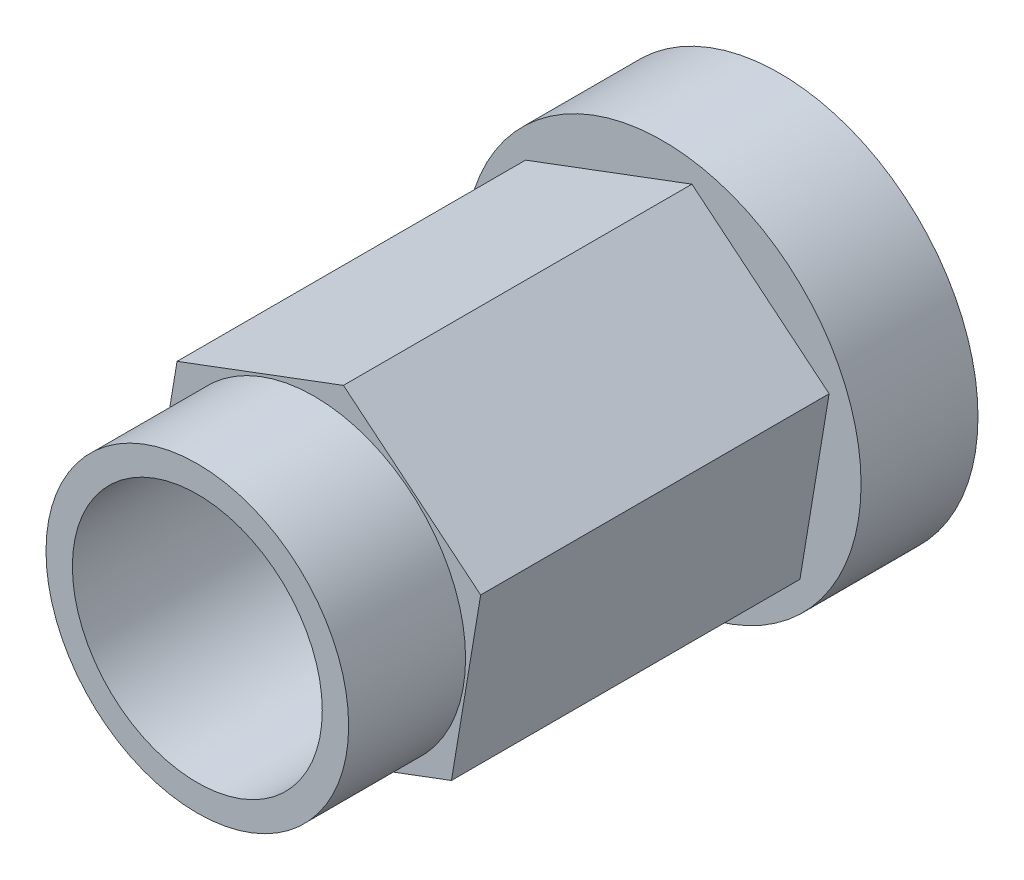
ISO-10303-21;
HEADER;
FILE_DESCRIPTION(('STEP AP214'),'2;1');
FILE_NAME('part.step','',(''),(''),'','','');
FILE_SCHEMA(('AUTOMOTIVE_DESIGN { 1 0 10303 214 1 1 1 1 }'));
ENDSEC;
DATA;
#1=APPLICATION_CONTEXT('core data for automotive mechanical design processes');
#2=APPLICATION_PROTOCOL_DEFINITION('international standard','automotive_design',2000,#1);
#3=PRODUCT_CONTEXT('',#1,'mechanical');
#4=PRODUCT('Part','Part','',(#3));
#5=PRODUCT_RELATED_PRODUCT_CATEGORY('part','',(#4));
#6=PRODUCT_DEFINITION_FORMATION('','',#4);
#7=PRODUCT_DEFINITION_CONTEXT('part definition',#1,'design');
#8=PRODUCT_DEFINITION('design','',#6,#7);
#9=PRODUCT_DEFINITION_SHAPE('','',#8);
#10=(LENGTH_UNIT() NAMED_UNIT(*) SI_UNIT(.MILLI.,.METRE.));
#11=(NAMED_UNIT(*) PLANE_ANGLE_UNIT() SI_UNIT($,.RADIAN.));
#12=(NAMED_UNIT(*) SI_UNIT($,.STERADIAN.) SOLID_ANGLE_UNIT());
#13=UNCERTAINTY_MEASURE_WITH_UNIT(LENGTH_MEASURE(1.E-05),#10,'distance_accuracy_value','');
#14=(GEOMETRIC_REPRESENTATION_CONTEXT(3) GLOBAL_UNCERTAINTY_ASSIGNED_CONTEXT((#13)) GLOBAL_UNIT_ASSIGNED_CONTEXT((#10,
#11,#12)) REPRESENTATION_CONTEXT('',''));
#15=CARTESIAN_POINT('',(0.,0.,0.));
#16=DIRECTION('',(0.,0.,1.));
#17=DIRECTION('',(1.,0.,0.));
#18=AXIS2_PLACEMENT_3D('',#15,#16,#17);
#19=CARTESIAN_POINT('',(-0.725690397107297,-0.272026556693025,1.52));
#20=DIRECTION('',(0.,0.,1.));
#21=DIRECTION('',(1.,0.,0.));
#22=AXIS2_PLACEMENT_3D('',#19,#20,#21);
#23=PLANE('',#22);
#24=DIRECTION('',(-0.164210696714167,-0.986425287127539,0.));
#25=VECTOR('',#24,1.);
#26=CARTESIAN_POINT('',(-0.598427107153816,0.492453040830824,1.52));
#27=LINE('',#26,#25);
#28=CARTESIAN_POINT('',(-0.598427107153816,0.492453040830824,1.52));
#29=VERTEX_POINT('',#28);
#30=CARTESIAN_POINT('',(-0.725690397107297,-0.272026556693025,1.52));
#31=VERTEX_POINT('',#30);
#32=EDGE_CURVE('E91',#29,#31,#27,.T.);
#33=ORIENTED_EDGE('',*,*,#32,.T.);
#34=DIRECTION('',(0.772164009230724,-0.63542327849138,0.));
#35=VECTOR('',#34,1.);
#36=CARTESIAN_POINT('',(-0.725690397107297,-0.272026556693025,1.52));
#37=LINE('',#36,#35);
#38=CARTESIAN_POINT('',(-0.127263289953481,-0.764479597523849,1.52));
#39=VERTEX_POINT('',#38);
#40=EDGE_CURVE('E123',#31,#39,#37,.T.);
#41=ORIENTED_EDGE('',*,*,#40,.T.);
#42=DIRECTION('',(0.936374705944891,0.351002008636158,0.));
#43=VECTOR('',#42,1.);
#44=CARTESIAN_POINT('',(-0.127263289953481,-0.764479597523849,1.52));
#45=LINE('',#44,#43);
#46=CARTESIAN_POINT('',(0.598427107153816,-0.492453040830824,1.52));
#47=VERTEX_POINT('',#46);
#48=EDGE_CURVE('E119',#39,#47,#45,.T.);
#49=ORIENTED_EDGE('',*,*,#48,.T.);
#50=DIRECTION('',(0.164210696714167,0.986425287127539,0.));
#51=VECTOR('',#50,1.);
#52=CARTESIAN_POINT('',(0.598427107153816,-0.492453040830824,1.52));
#53=LINE('',#52,#51);
#54=CARTESIAN_POINT('',(0.725690397107297,0.272026556693025,1.52));
#55=VERTEX_POINT('',#54);
#56=EDGE_CURVE('E135',#47,#55,#53,.T.);
#57=ORIENTED_EDGE('',*,*,#56,.T.);
#58=DIRECTION('',(-0.772164009230724,0.63542327849138,0.));
#59=VECTOR('',#58,1.);
#60=CARTESIAN_POINT('',(0.725690397107297,0.272026556693025,1.52));
#61=LINE('',#60,#59);
#62=CARTESIAN_POINT('',(0.127263289953481,0.764479597523849,1.52));
#63=VERTEX_POINT('',#62);
#64=EDGE_CURVE('E136',#55,#63,#61,.T.);
#65=ORIENTED_EDGE('',*,*,#64,.T.);
#66=DIRECTION('',(-0.936374705944891,-0.351002008636158,0.));
#67=VECTOR('',#66,1.);
#68=CARTESIAN_POINT('',(0.127263289953481,0.764479597523849,1.52));
#69=LINE('',#68,#67);
#70=EDGE_CURVE('E48',#63,#29,#69,.T.);
#71=ORIENTED_EDGE('',*,*,#70,.T.);
#72=EDGE_LOOP('',(#33,#41,#49,#57,#65,#71));
#73=FACE_BOUND('',#72,.T.);
#74=CARTESIAN_POINT('',(0.,0.,1.52));
#75=DIRECTION('',(0.,0.,1.));
#76=DIRECTION('',(1.,0.,0.));
#77=AXIS2_PLACEMENT_3D('',#74,#75,#76);
#78=CIRCLE('',#77,0.66);
#79=CARTESIAN_POINT('',(0.66,0.,1.52));
#80=VERTEX_POINT('',#79);
#81=EDGE_CURVE('E143',#80,#80,#78,.T.);
#82=ORIENTED_EDGE('',*,*,#81,.F.);
#83=EDGE_LOOP('',(#82));
#84=FACE_BOUND('',#83,.T.);
#85=ADVANCED_FACE('F32',(#73,#84),#23,.T.);
#86=CARTESIAN_POINT('',(-0.598427107153816,0.492453040830824,1.52));
#87=DIRECTION('',(0.986425287127539,-0.164210696714167,0.));
#88=DIRECTION('',(0.164210696714167,0.986425287127539,0.));
#89=AXIS2_PLACEMENT_3D('',#86,#87,#88);
#90=PLANE('',#89);
#91=DIRECTION('',(-0.164210696714167,-0.986425287127539,0.));
#92=VECTOR('',#91,1.);
#93=CARTESIAN_POINT('',(-0.598427107153816,0.492453040830824,0.));
#94=LINE('',#93,#92);
#95=CARTESIAN_POINT('',(-0.598427107153816,0.492453040830824,0.));
#96=VERTEX_POINT('',#95);
#97=CARTESIAN_POINT('',(-0.725690397107297,-0.272026556693025,0.));
#98=VERTEX_POINT('',#97);
#99=EDGE_CURVE('E87',#96,#98,#94,.T.);
#100=ORIENTED_EDGE('',*,*,#99,.T.);
#101=DIRECTION('',(0.,0.,-1.));
#102=VECTOR('',#101,1.);
#103=CARTESIAN_POINT('',(-0.725690397107297,-0.272026556693025,1.52));
#104=LINE('',#103,#102);
#105=EDGE_CURVE('E11',#31,#98,#104,.T.);
#106=ORIENTED_EDGE('',*,*,#105,.F.);
#107=ORIENTED_EDGE('',*,*,#32,.F.);
#108=DIRECTION('',(0.,0.,-1.));
#109=VECTOR('',#108,1.);
#110=CARTESIAN_POINT('',(-0.598427107153816,0.492453040830824,1.52));
#111=LINE('',#110,#109);
#112=EDGE_CURVE('E104',#29,#96,#111,.T.);
#113=ORIENTED_EDGE('',*,*,#112,.T.);
#114=EDGE_LOOP('',(#100,#106,#107,#113));
#115=FACE_BOUND('',#114,.T.);
#116=ADVANCED_FACE('F34',(#115),#90,.F.);
#117=CARTESIAN_POINT('',(-0.725690397107297,-0.272026556693025,1.52));
#118=DIRECTION('',(0.63542327849138,0.772164009230724,0.));
#119=DIRECTION('',(-0.772164009230724,0.63542327849138,0.));
#120=AXIS2_PLACEMENT_3D('',#117,#118,#119);
#121=PLANE('',#120);
#122=DIRECTION('',(0.772164009230724,-0.63542327849138,0.));
#123=VECTOR('',#122,1.);
#124=CARTESIAN_POINT('',(-0.725690397107297,-0.272026556693025,0.));
#125=LINE('',#124,#123);
#126=CARTESIAN_POINT('',(-0.127263289953481,-0.764479597523849,0.));
#127=VERTEX_POINT('',#126);
#128=EDGE_CURVE('E124',#98,#127,#125,.T.);
#129=ORIENTED_EDGE('',*,*,#128,.T.);
#130=DIRECTION('',(0.,0.,-1.));
#131=VECTOR('',#130,1.);
#132=CARTESIAN_POINT('',(-0.127263289953481,-0.764479597523849,1.52));
#133=LINE('',#132,#131);
#134=EDGE_CURVE('E41',#39,#127,#133,.T.);
#135=ORIENTED_EDGE('',*,*,#134,.F.);
#136=ORIENTED_EDGE('',*,*,#40,.F.);
#137=ORIENTED_EDGE('',*,*,#105,.T.);
#138=EDGE_LOOP('',(#129,#135,#136,#137));
#139=FACE_BOUND('',#138,.T.);
#140=ADVANCED_FACE('F122',(#139),#121,.F.);
#141=CARTESIAN_POINT('',(-0.127263289953481,-0.764479597523849,1.52));
#142=DIRECTION('',(-0.351002008636158,0.936374705944891,0.));
#143=DIRECTION('',(-0.936374705944892,-0.351002008636158,0.));
#144=AXIS2_PLACEMENT_3D('',#141,#142,#143);
#145=PLANE('',#144);
#146=DIRECTION('',(0.936374705944891,0.351002008636158,0.));
#147=VECTOR('',#146,1.);
#148=CARTESIAN_POINT('',(-0.127263289953481,-0.764479597523849,0.));
#149=LINE('',#148,#147);
#150=CARTESIAN_POINT('',(0.598427107153816,-0.492453040830824,0.));
#151=VERTEX_POINT('',#150);
#152=EDGE_CURVE('E118',#127,#151,#149,.T.);
#153=ORIENTED_EDGE('',*,*,#152,.T.);
#154=DIRECTION('',(0.,0.,-1.));
#155=VECTOR('',#154,1.);
#156=CARTESIAN_POINT('',(0.598427107153816,-0.492453040830824,1.52));
#157=LINE('',#156,#155);
#158=EDGE_CURVE('E106',#47,#151,#157,.T.);
#159=ORIENTED_EDGE('',*,*,#158,.F.);
#160=ORIENTED_EDGE('',*,*,#48,.F.);
#161=ORIENTED_EDGE('',*,*,#134,.T.);
#162=EDGE_LOOP('',(#153,#159,#160,#161));
#163=FACE_BOUND('',#162,.T.);
#164=ADVANCED_FACE('F116',(#163),#145,.F.);
#165=CARTESIAN_POINT('',(0.598427107153816,-0.492453040830824,1.52));
#166=DIRECTION('',(-0.986425287127539,0.164210696714167,0.));
#167=DIRECTION('',(-0.164210696714167,-0.986425287127539,0.));
#168=AXIS2_PLACEMENT_3D('',#165,#166,#167);
#169=PLANE('',#168);
#170=DIRECTION('',(0.164210696714167,0.986425287127539,0.));
#171=VECTOR('',#170,1.);
#172=CARTESIAN_POINT('',(0.598427107153816,-0.492453040830824,0.));
#173=LINE('',#172,#171);
#174=CARTESIAN_POINT('',(0.725690397107297,0.272026556693025,0.));
#175=VERTEX_POINT('',#174);
#176=EDGE_CURVE('E101',#151,#175,#173,.T.);
#177=ORIENTED_EDGE('',*,*,#176,.T.);
#178=DIRECTION('',(0.,0.,-1.));
#179=VECTOR('',#178,1.);
#180=CARTESIAN_POINT('',(0.725690397107297,0.272026556693025,1.52));
#181=LINE('',#180,#179);
#182=EDGE_CURVE('E100',#55,#175,#181,.T.);
#183=ORIENTED_EDGE('',*,*,#182,.F.);
#184=ORIENTED_EDGE('',*,*,#56,.F.);
#185=ORIENTED_EDGE('',*,*,#158,.T.);
#186=EDGE_LOOP('',(#177,#183,#184,#185));
#187=FACE_BOUND('',#186,.T.);
#188=ADVANCED_FACE('F133',(#187),#169,.F.);
#189=CARTESIAN_POINT('',(0.725690397107297,0.272026556693025,1.52));
#190=DIRECTION('',(-0.63542327849138,-0.772164009230724,0.));
#191=DIRECTION('',(0.772164009230724,-0.63542327849138,0.));
#192=AXIS2_PLACEMENT_3D('',#189,#190,#191);
#193=PLANE('',#192);
#194=DIRECTION('',(-0.772164009230724,0.63542327849138,0.));
#195=VECTOR('',#194,1.);
#196=CARTESIAN_POINT('',(0.725690397107297,0.272026556693025,0.));
#197=LINE('',#196,#195);
#198=CARTESIAN_POINT('',(0.127263289953481,0.764479597523849,0.));
#199=VERTEX_POINT('',#198);
#200=EDGE_CURVE('E84',#175,#199,#197,.T.);
#201=ORIENTED_EDGE('',*,*,#200,.T.);
#202=DIRECTION('',(0.,0.,-1.));
#203=VECTOR('',#202,1.);
#204=CARTESIAN_POINT('',(0.127263289953481,0.764479597523849,1.52));
#205=LINE('',#204,#203);
#206=EDGE_CURVE('E98',#63,#199,#205,.T.);
#207=ORIENTED_EDGE('',*,*,#206,.F.);
#208=ORIENTED_EDGE('',*,*,#64,.F.);
#209=ORIENTED_EDGE('',*,*,#182,.T.);
#210=EDGE_LOOP('',(#201,#207,#208,#209));
#211=FACE_BOUND('',#210,.T.);
#212=ADVANCED_FACE('F96',(#211),#193,.F.);
#213=CARTESIAN_POINT('',(0.127263289953481,0.764479597523849,1.52));
#214=DIRECTION('',(0.351002008636158,-0.936374705944891,0.));
#215=DIRECTION('',(0.936374705944892,0.351002008636158,0.));
#216=AXIS2_PLACEMENT_3D('',#213,#214,#215);
#217=PLANE('',#216);
#218=DIRECTION('',(-0.936374705944891,-0.351002008636158,0.));
#219=VECTOR('',#218,1.);
#220=CARTESIAN_POINT('',(0.127263289953481,0.764479597523849,0.));
#221=LINE('',#220,#219);
#222=EDGE_CURVE('E81',#199,#96,#221,.T.);
#223=ORIENTED_EDGE('',*,*,#222,.T.);
#224=ORIENTED_EDGE('',*,*,#112,.F.);
#225=ORIENTED_EDGE('',*,*,#70,.F.);
#226=ORIENTED_EDGE('',*,*,#206,.T.);
#227=EDGE_LOOP('',(#223,#224,#225,#226));
#228=FACE_BOUND('',#227,.T.);
#229=ADVANCED_FACE('F103',(#228),#217,.F.);
#230=CARTESIAN_POINT('',(0.,0.,2.03));
#231=DIRECTION('',(0.,0.,-1.));
#232=DIRECTION('',(-1.,0.,0.));
#233=AXIS2_PLACEMENT_3D('',#230,#231,#232);
#234=CYLINDRICAL_SURFACE('',#233,0.66);
#235=CARTESIAN_POINT('',(0.,0.,2.03));
#236=DIRECTION('',(0.,0.,1.));
#237=DIRECTION('',(1.,0.,0.));
#238=AXIS2_PLACEMENT_3D('',#235,#236,#237);
#239=CIRCLE('',#238,0.66);
#240=CARTESIAN_POINT('',(0.66,0.,2.03));
#241=VERTEX_POINT('',#240);
#242=EDGE_CURVE('E128',#241,#241,#239,.T.);
#243=ORIENTED_EDGE('',*,*,#242,.F.);
#244=EDGE_LOOP('',(#243));
#245=FACE_BOUND('',#244,.T.);
#246=ORIENTED_EDGE('',*,*,#81,.T.);
#247=EDGE_LOOP('',(#246));
#248=FACE_BOUND('',#247,.T.);
#249=ADVANCED_FACE('F187',(#245,#248),#234,.T.);
#250=CARTESIAN_POINT('',(0.,0.,2.03));
#251=DIRECTION('',(0.,0.,1.));
#252=DIRECTION('',(1.,0.,0.));
#253=AXIS2_PLACEMENT_3D('',#250,#251,#252);
#254=PLANE('',#253);
#255=CARTESIAN_POINT('',(0.,0.,2.03));
#256=DIRECTION('',(0.,0.,-1.));
#257=DIRECTION('',(-1.,0.,0.));
#258=AXIS2_PLACEMENT_3D('',#255,#256,#257);
#259=CIRCLE('',#258,0.545);
#260=CARTESIAN_POINT('',(-0.545,0.,2.03));
#261=VERTEX_POINT('',#260);
#262=EDGE_CURVE('E152',#261,#261,#259,.T.);
#263=ORIENTED_EDGE('',*,*,#262,.T.);
#264=EDGE_LOOP('',(#263));
#265=FACE_BOUND('',#264,.T.);
#266=ORIENTED_EDGE('',*,*,#242,.T.);
#267=EDGE_LOOP('',(#266));
#268=FACE_BOUND('',#267,.T.);
#269=ADVANCED_FACE('F161',(#265,#268),#254,.T.);
#270=CARTESIAN_POINT('',(0.,0.,0.));
#271=DIRECTION('',(0.,0.,-1.));
#272=DIRECTION('',(-1.,0.,0.));
#273=AXIS2_PLACEMENT_3D('',#270,#271,#272);
#274=PLANE('',#273);
#275=CARTESIAN_POINT('',(0.,0.,0.));
#276=DIRECTION('',(0.,0.,-1.));
#277=DIRECTION('',(-1.,0.,0.));
#278=AXIS2_PLACEMENT_3D('',#275,#276,#277);
#279=CIRCLE('',#278,0.865);
#280=CARTESIAN_POINT('',(-0.865,0.,0.));
#281=VERTEX_POINT('',#280);
#282=EDGE_CURVE('E149',#281,#281,#279,.T.);
#283=ORIENTED_EDGE('',*,*,#282,.F.);
#284=EDGE_LOOP('',(#283));
#285=FACE_BOUND('',#284,.T.);
#286=ORIENTED_EDGE('',*,*,#128,.F.);
#287=ORIENTED_EDGE('',*,*,#99,.F.);
#288=ORIENTED_EDGE('',*,*,#222,.F.);
#289=ORIENTED_EDGE('',*,*,#200,.F.);
#290=ORIENTED_EDGE('',*,*,#176,.F.);
#291=ORIENTED_EDGE('',*,*,#152,.F.);
#292=EDGE_LOOP('',(#286,#287,#288,#289,#290,#291));
#293=FACE_BOUND('',#292,.T.);
#294=ADVANCED_FACE('F83',(#285,#293),#274,.F.);
#295=CARTESIAN_POINT('',(0.,0.,-0.51));
#296=DIRECTION('',(0.,0.,1.));
#297=DIRECTION('',(1.,0.,0.));
#298=AXIS2_PLACEMENT_3D('',#295,#296,#297);
#299=CYLINDRICAL_SURFACE('',#298,0.865);
#300=CARTESIAN_POINT('',(0.,0.,-0.51));
#301=DIRECTION('',(0.,0.,-1.));
#302=DIRECTION('',(-1.,0.,0.));
#303=AXIS2_PLACEMENT_3D('',#300,#301,#302);
#304=CIRCLE('',#303,0.865);
#305=CARTESIAN_POINT('',(-0.865,0.,-0.51));
#306=VERTEX_POINT('',#305);
#307=EDGE_CURVE('E146',#306,#306,#304,.T.);
#308=ORIENTED_EDGE('',*,*,#307,.F.);
#309=EDGE_LOOP('',(#308));
#310=FACE_BOUND('',#309,.T.);
#311=ORIENTED_EDGE('',*,*,#282,.T.);
#312=EDGE_LOOP('',(#311));
#313=FACE_BOUND('',#312,.T.);
#314=ADVANCED_FACE('F173',(#310,#313),#299,.T.);
#315=CARTESIAN_POINT('',(0.,0.,-0.51));
#316=DIRECTION('',(0.,0.,-1.));
#317=DIRECTION('',(-1.,0.,0.));
#318=AXIS2_PLACEMENT_3D('',#315,#316,#317);
#319=PLANE('',#318);
#320=CARTESIAN_POINT('',(0.,0.,-0.51));
#321=DIRECTION('',(0.,0.,-1.));
#322=DIRECTION('',(-1.,0.,0.));
#323=AXIS2_PLACEMENT_3D('',#320,#321,#322);
#324=CIRCLE('',#323,0.545);
#325=CARTESIAN_POINT('',(-0.545,0.,-0.51));
#326=VERTEX_POINT('',#325);
#327=EDGE_CURVE('E155',#326,#326,#324,.T.);
#328=ORIENTED_EDGE('',*,*,#327,.F.);
#329=EDGE_LOOP('',(#328));
#330=FACE_BOUND('',#329,.T.);
#331=ORIENTED_EDGE('',*,*,#307,.T.);
#332=EDGE_LOOP('',(#331));
#333=FACE_BOUND('',#332,.T.);
#334=ADVANCED_FACE('F167',(#330,#333),#319,.T.);
#335=CARTESIAN_POINT('',(0.,0.,2.03));
#336=DIRECTION('',(0.,0.,-1.));
#337=DIRECTION('',(-1.,0.,0.));
#338=AXIS2_PLACEMENT_3D('',#335,#336,#337);
#339=CYLINDRICAL_SURFACE('',#338,0.545);
#340=ORIENTED_EDGE('',*,*,#262,.F.);
#341=EDGE_LOOP('',(#340));
#342=FACE_BOUND('',#341,.T.);
#343=ORIENTED_EDGE('',*,*,#327,.T.);
#344=EDGE_LOOP('',(#343));
#345=FACE_BOUND('',#344,.T.);
#346=ADVANCED_FACE('F164',(#342,#345),#339,.F.);
#347=CLOSED_SHELL('',(#85,#116,#140,#164,#188,#212,#229,#249,#269,#294,#314,#334,#346));
#348=MANIFOLD_SOLID_BREP('B2',#347);
#349=ADVANCED_BREP_SHAPE_REPRESENTATION('',(#18,#348),#14);
#350=SHAPE_DEFINITION_REPRESENTATION(#9,#349);
ENDSEC;
END-ISO-10303-21;
